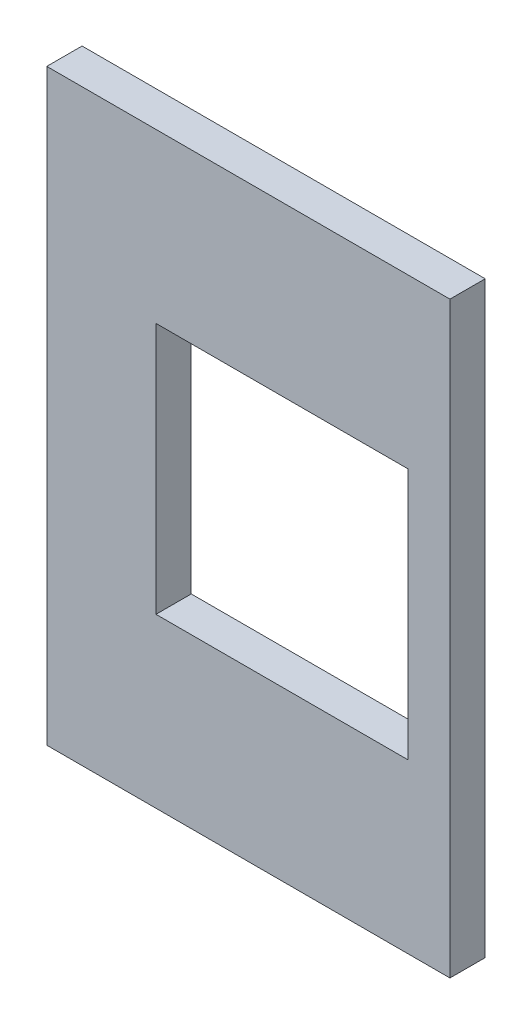
ISO-10303-21;
HEADER;
FILE_DESCRIPTION(('STEP AP214'),'2;1');
FILE_NAME('part.step','',(''),(''),'','','');
FILE_SCHEMA(('AUTOMOTIVE_DESIGN { 1 0 10303 214 1 1 1 1 }'));
ENDSEC;
DATA;
#1=APPLICATION_CONTEXT('core data for automotive mechanical design processes');
#2=APPLICATION_PROTOCOL_DEFINITION('international standard','automotive_design',2000,#1);
#3=PRODUCT_CONTEXT('',#1,'mechanical');
#4=PRODUCT('Part','Part','',(#3));
#5=PRODUCT_RELATED_PRODUCT_CATEGORY('part','',(#4));
#6=PRODUCT_DEFINITION_FORMATION('','',#4);
#7=PRODUCT_DEFINITION_CONTEXT('part definition',#1,'design');
#8=PRODUCT_DEFINITION('design','',#6,#7);
#9=PRODUCT_DEFINITION_SHAPE('','',#8);
#10=(LENGTH_UNIT() NAMED_UNIT(*) SI_UNIT(.MILLI.,.METRE.));
#11=(NAMED_UNIT(*) PLANE_ANGLE_UNIT() SI_UNIT($,.RADIAN.));
#12=(NAMED_UNIT(*) SI_UNIT($,.STERADIAN.) SOLID_ANGLE_UNIT());
#13=UNCERTAINTY_MEASURE_WITH_UNIT(LENGTH_MEASURE(1.E-05),#10,'distance_accuracy_value','');
#14=(GEOMETRIC_REPRESENTATION_CONTEXT(3) GLOBAL_UNCERTAINTY_ASSIGNED_CONTEXT((#13)) GLOBAL_UNIT_ASSIGNED_CONTEXT((#10,
#11,#12)) REPRESENTATION_CONTEXT('',''));
#15=CARTESIAN_POINT('',(0.,0.,0.));
#16=DIRECTION('',(0.,0.,1.));
#17=DIRECTION('',(1.,0.,0.));
#18=AXIS2_PLACEMENT_3D('',#15,#16,#17);
#19=CARTESIAN_POINT('',(0.,0.,2.667));
#20=DIRECTION('',(0.,0.,-1.));
#21=DIRECTION('',(-1.,0.,0.));
#22=AXIS2_PLACEMENT_3D('',#19,#20,#21);
#23=PLANE('',#22);
#24=DIRECTION('',(0.,1.,0.));
#25=VECTOR('',#24,1.);
#26=CARTESIAN_POINT('',(12.7,0.,2.667));
#27=LINE('',#26,#25);
#28=CARTESIAN_POINT('',(12.7,-22.225,2.667));
#29=VERTEX_POINT('',#28);
#30=CARTESIAN_POINT('',(12.7,22.225,2.667));
#31=VERTEX_POINT('',#30);
#32=EDGE_CURVE('E167',#29,#31,#27,.T.);
#33=ORIENTED_EDGE('',*,*,#32,.T.);
#34=DIRECTION('',(-1.,0.,0.));
#35=VECTOR('',#34,1.);
#36=CARTESIAN_POINT('',(0.,22.225,2.667));
#37=LINE('',#36,#35);
#38=CARTESIAN_POINT('',(-17.78,22.225,2.667));
#39=VERTEX_POINT('',#38);
#40=EDGE_CURVE('E175',#31,#39,#37,.T.);
#41=ORIENTED_EDGE('',*,*,#40,.T.);
#42=DIRECTION('',(0.,1.,0.));
#43=VECTOR('',#42,1.);
#44=CARTESIAN_POINT('',(-17.78,0.,2.667));
#45=LINE('',#44,#43);
#46=CARTESIAN_POINT('',(-17.78,-22.225,2.667));
#47=VERTEX_POINT('',#46);
#48=EDGE_CURVE('E127',#47,#39,#45,.T.);
#49=ORIENTED_EDGE('',*,*,#48,.F.);
#50=DIRECTION('',(1.,0.,0.));
#51=VECTOR('',#50,1.);
#52=CARTESIAN_POINT('',(0.,-22.225,2.667));
#53=LINE('',#52,#51);
#54=EDGE_CURVE('E170',#47,#29,#53,.T.);
#55=ORIENTED_EDGE('',*,*,#54,.T.);
#56=EDGE_LOOP('',(#33,#41,#49,#55));
#57=FACE_BOUND('',#56,.T.);
#58=DIRECTION('',(0.,-1.,0.));
#59=VECTOR('',#58,1.);
#60=CARTESIAN_POINT('',(-9.525,0.,2.667));
#61=LINE('',#60,#59);
#62=CARTESIAN_POINT('',(-9.525,9.525,2.667));
#63=VERTEX_POINT('',#62);
#64=CARTESIAN_POINT('',(-9.525,-9.525,2.667));
#65=VERTEX_POINT('',#64);
#66=EDGE_CURVE('E149',#63,#65,#61,.T.);
#67=ORIENTED_EDGE('',*,*,#66,.F.);
#68=DIRECTION('',(-1.,0.,0.));
#69=VECTOR('',#68,1.);
#70=CARTESIAN_POINT('',(0.,9.525,2.667));
#71=LINE('',#70,#69);
#72=CARTESIAN_POINT('',(9.525,9.525,2.667));
#73=VERTEX_POINT('',#72);
#74=EDGE_CURVE('E42',#73,#63,#71,.T.);
#75=ORIENTED_EDGE('',*,*,#74,.F.);
#76=DIRECTION('',(0.,1.,0.));
#77=VECTOR('',#76,1.);
#78=CARTESIAN_POINT('',(9.525,0.,2.667));
#79=LINE('',#78,#77);
#80=CARTESIAN_POINT('',(9.525,-9.525,2.667));
#81=VERTEX_POINT('',#80);
#82=EDGE_CURVE('E186',#81,#73,#79,.T.);
#83=ORIENTED_EDGE('',*,*,#82,.F.);
#84=DIRECTION('',(1.,0.,0.));
#85=VECTOR('',#84,1.);
#86=CARTESIAN_POINT('',(0.,-9.525,2.667));
#87=LINE('',#86,#85);
#88=EDGE_CURVE('E184',#65,#81,#87,.T.);
#89=ORIENTED_EDGE('',*,*,#88,.F.);
#90=EDGE_LOOP('',(#67,#75,#83,#89));
#91=FACE_BOUND('',#90,.T.);
#92=ADVANCED_FACE('F39',(#57,#91),#23,.F.);
#93=CARTESIAN_POINT('',(0.,0.,0.));
#94=DIRECTION('',(0.,0.,-1.));
#95=DIRECTION('',(-1.,0.,0.));
#96=AXIS2_PLACEMENT_3D('',#93,#94,#95);
#97=PLANE('',#96);
#98=DIRECTION('',(0.,1.,0.));
#99=VECTOR('',#98,1.);
#100=CARTESIAN_POINT('',(12.7,-22.225,0.));
#101=LINE('',#100,#99);
#102=CARTESIAN_POINT('',(12.7,-22.225,0.));
#103=VERTEX_POINT('',#102);
#104=CARTESIAN_POINT('',(12.7,22.225,0.));
#105=VERTEX_POINT('',#104);
#106=EDGE_CURVE('E112',#103,#105,#101,.T.);
#107=ORIENTED_EDGE('',*,*,#106,.F.);
#108=DIRECTION('',(1.,0.,0.));
#109=VECTOR('',#108,1.);
#110=CARTESIAN_POINT('',(-12.7,-22.225,0.));
#111=LINE('',#110,#109);
#112=CARTESIAN_POINT('',(-17.78,-22.225,0.));
#113=VERTEX_POINT('',#112);
#114=EDGE_CURVE('E111',#113,#103,#111,.T.);
#115=ORIENTED_EDGE('',*,*,#114,.F.);
#116=DIRECTION('',(0.,-1.,0.));
#117=VECTOR('',#116,1.);
#118=CARTESIAN_POINT('',(-17.78,22.225,0.));
#119=LINE('',#118,#117);
#120=CARTESIAN_POINT('',(-17.78,22.225,0.));
#121=VERTEX_POINT('',#120);
#122=EDGE_CURVE('E115',#121,#113,#119,.T.);
#123=ORIENTED_EDGE('',*,*,#122,.F.);
#124=DIRECTION('',(-1.,0.,0.));
#125=VECTOR('',#124,1.);
#126=CARTESIAN_POINT('',(-12.7,22.225,0.));
#127=LINE('',#126,#125);
#128=EDGE_CURVE('E101',#105,#121,#127,.T.);
#129=ORIENTED_EDGE('',*,*,#128,.F.);
#130=EDGE_LOOP('',(#107,#115,#123,#129));
#131=FACE_BOUND('',#130,.T.);
#132=DIRECTION('',(-1.,0.,0.));
#133=VECTOR('',#132,1.);
#134=CARTESIAN_POINT('',(-9.525,9.525,0.));
#135=LINE('',#134,#133);
#136=CARTESIAN_POINT('',(9.525,9.525,0.));
#137=VERTEX_POINT('',#136);
#138=CARTESIAN_POINT('',(-9.525,9.525,0.));
#139=VERTEX_POINT('',#138);
#140=EDGE_CURVE('E145',#137,#139,#135,.T.);
#141=ORIENTED_EDGE('',*,*,#140,.T.);
#142=DIRECTION('',(0.,-1.,0.));
#143=VECTOR('',#142,1.);
#144=CARTESIAN_POINT('',(-9.525,9.525,0.));
#145=LINE('',#144,#143);
#146=CARTESIAN_POINT('',(-9.525,-9.525,0.));
#147=VERTEX_POINT('',#146);
#148=EDGE_CURVE('E133',#139,#147,#145,.T.);
#149=ORIENTED_EDGE('',*,*,#148,.T.);
#150=DIRECTION('',(1.,0.,0.));
#151=VECTOR('',#150,1.);
#152=CARTESIAN_POINT('',(-9.525,-9.525,0.));
#153=LINE('',#152,#151);
#154=CARTESIAN_POINT('',(9.525,-9.525,0.));
#155=VERTEX_POINT('',#154);
#156=EDGE_CURVE('E137',#147,#155,#153,.T.);
#157=ORIENTED_EDGE('',*,*,#156,.T.);
#158=DIRECTION('',(0.,1.,0.));
#159=VECTOR('',#158,1.);
#160=CARTESIAN_POINT('',(9.525,9.525,0.));
#161=LINE('',#160,#159);
#162=EDGE_CURVE('E141',#155,#137,#161,.T.);
#163=ORIENTED_EDGE('',*,*,#162,.T.);
#164=EDGE_LOOP('',(#141,#149,#157,#163));
#165=FACE_BOUND('',#164,.T.);
#166=ADVANCED_FACE('F116',(#131,#165),#97,.T.);
#167=CARTESIAN_POINT('',(12.7,-22.225,3.175));
#168=DIRECTION('',(-1.,0.,0.));
#169=DIRECTION('',(0.,-1.,0.));
#170=AXIS2_PLACEMENT_3D('',#167,#168,#169);
#171=PLANE('',#170);
#172=ORIENTED_EDGE('',*,*,#106,.T.);
#173=DIRECTION('',(0.,0.,-1.));
#174=VECTOR('',#173,1.);
#175=CARTESIAN_POINT('',(12.7,22.225,3.175));
#176=LINE('',#175,#174);
#177=EDGE_CURVE('E12',#31,#105,#176,.T.);
#178=ORIENTED_EDGE('',*,*,#177,.F.);
#179=ORIENTED_EDGE('',*,*,#32,.F.);
#180=DIRECTION('',(0.,0.,-1.));
#181=VECTOR('',#180,1.);
#182=CARTESIAN_POINT('',(12.7,-22.225,3.175));
#183=LINE('',#182,#181);
#184=EDGE_CURVE('E49',#29,#103,#183,.T.);
#185=ORIENTED_EDGE('',*,*,#184,.T.);
#186=EDGE_LOOP('',(#172,#178,#179,#185));
#187=FACE_BOUND('',#186,.T.);
#188=ADVANCED_FACE('F206',(#187),#171,.F.);
#189=CARTESIAN_POINT('',(-12.7,22.225,3.175));
#190=DIRECTION('',(0.,-1.,0.));
#191=DIRECTION('',(1.,0.,0.));
#192=AXIS2_PLACEMENT_3D('',#189,#190,#191);
#193=PLANE('',#192);
#194=ORIENTED_EDGE('',*,*,#128,.T.);
#195=DIRECTION('',(0.,0.,-1.));
#196=VECTOR('',#195,1.);
#197=CARTESIAN_POINT('',(-17.78,22.225,3.175));
#198=LINE('',#197,#196);
#199=EDGE_CURVE('E105',#39,#121,#198,.T.);
#200=ORIENTED_EDGE('',*,*,#199,.F.);
#201=ORIENTED_EDGE('',*,*,#40,.F.);
#202=ORIENTED_EDGE('',*,*,#177,.T.);
#203=EDGE_LOOP('',(#194,#200,#201,#202));
#204=FACE_BOUND('',#203,.T.);
#205=ADVANCED_FACE('F103',(#204),#193,.F.);
#206=CARTESIAN_POINT('',(-12.7,-22.225,3.175));
#207=DIRECTION('',(0.,1.,0.));
#208=DIRECTION('',(-1.,0.,0.));
#209=AXIS2_PLACEMENT_3D('',#206,#207,#208);
#210=PLANE('',#209);
#211=ORIENTED_EDGE('',*,*,#114,.T.);
#212=ORIENTED_EDGE('',*,*,#184,.F.);
#213=ORIENTED_EDGE('',*,*,#54,.F.);
#214=DIRECTION('',(0.,0.,1.));
#215=VECTOR('',#214,1.);
#216=CARTESIAN_POINT('',(-17.78,-22.225,0.));
#217=LINE('',#216,#215);
#218=EDGE_CURVE('E122',#113,#47,#217,.T.);
#219=ORIENTED_EDGE('',*,*,#218,.F.);
#220=EDGE_LOOP('',(#211,#212,#213,#219));
#221=FACE_BOUND('',#220,.T.);
#222=ADVANCED_FACE('F217',(#221),#210,.F.);
#223=CARTESIAN_POINT('',(-9.525,9.525,3.175));
#224=DIRECTION('',(1.,0.,0.));
#225=DIRECTION('',(0.,1.,0.));
#226=AXIS2_PLACEMENT_3D('',#223,#224,#225);
#227=PLANE('',#226);
#228=ORIENTED_EDGE('',*,*,#148,.F.);
#229=DIRECTION('',(0.,0.,-1.));
#230=VECTOR('',#229,1.);
#231=CARTESIAN_POINT('',(-9.525,9.525,3.175));
#232=LINE('',#231,#230);
#233=EDGE_CURVE('E150',#63,#139,#232,.T.);
#234=ORIENTED_EDGE('',*,*,#233,.F.);
#235=ORIENTED_EDGE('',*,*,#66,.T.);
#236=DIRECTION('',(0.,0.,-1.));
#237=VECTOR('',#236,1.);
#238=CARTESIAN_POINT('',(-9.525,-9.525,3.175));
#239=LINE('',#238,#237);
#240=EDGE_CURVE('E159',#65,#147,#239,.T.);
#241=ORIENTED_EDGE('',*,*,#240,.T.);
#242=EDGE_LOOP('',(#228,#234,#235,#241));
#243=FACE_BOUND('',#242,.T.);
#244=ADVANCED_FACE('F198',(#243),#227,.T.);
#245=CARTESIAN_POINT('',(-9.525,-9.525,3.175));
#246=DIRECTION('',(0.,1.,0.));
#247=DIRECTION('',(-1.,0.,0.));
#248=AXIS2_PLACEMENT_3D('',#245,#246,#247);
#249=PLANE('',#248);
#250=ORIENTED_EDGE('',*,*,#156,.F.);
#251=ORIENTED_EDGE('',*,*,#240,.F.);
#252=ORIENTED_EDGE('',*,*,#88,.T.);
#253=DIRECTION('',(0.,0.,-1.));
#254=VECTOR('',#253,1.);
#255=CARTESIAN_POINT('',(9.525,-9.525,3.175));
#256=LINE('',#255,#254);
#257=EDGE_CURVE('E156',#81,#155,#256,.T.);
#258=ORIENTED_EDGE('',*,*,#257,.T.);
#259=EDGE_LOOP('',(#250,#251,#252,#258));
#260=FACE_BOUND('',#259,.T.);
#261=ADVANCED_FACE('F202',(#260),#249,.T.);
#262=CARTESIAN_POINT('',(9.525,9.525,3.175));
#263=DIRECTION('',(-1.,0.,0.));
#264=DIRECTION('',(0.,-1.,0.));
#265=AXIS2_PLACEMENT_3D('',#262,#263,#264);
#266=PLANE('',#265);
#267=ORIENTED_EDGE('',*,*,#162,.F.);
#268=ORIENTED_EDGE('',*,*,#257,.F.);
#269=ORIENTED_EDGE('',*,*,#82,.T.);
#270=DIRECTION('',(0.,0.,-1.));
#271=VECTOR('',#270,1.);
#272=CARTESIAN_POINT('',(9.525,9.525,3.175));
#273=LINE('',#272,#271);
#274=EDGE_CURVE('E57',#73,#137,#273,.T.);
#275=ORIENTED_EDGE('',*,*,#274,.T.);
#276=EDGE_LOOP('',(#267,#268,#269,#275));
#277=FACE_BOUND('',#276,.T.);
#278=ADVANCED_FACE('F204',(#277),#266,.T.);
#279=CARTESIAN_POINT('',(-9.525,9.525,3.175));
#280=DIRECTION('',(0.,-1.,0.));
#281=DIRECTION('',(1.,0.,0.));
#282=AXIS2_PLACEMENT_3D('',#279,#280,#281);
#283=PLANE('',#282);
#284=ORIENTED_EDGE('',*,*,#140,.F.);
#285=ORIENTED_EDGE('',*,*,#274,.F.);
#286=ORIENTED_EDGE('',*,*,#74,.T.);
#287=ORIENTED_EDGE('',*,*,#233,.T.);
#288=EDGE_LOOP('',(#284,#285,#286,#287));
#289=FACE_BOUND('',#288,.T.);
#290=ADVANCED_FACE('F194',(#289),#283,.T.);
#291=CARTESIAN_POINT('',(-17.78,0.,0.));
#292=DIRECTION('',(-1.,0.,0.));
#293=DIRECTION('',(0.,0.,1.));
#294=AXIS2_PLACEMENT_3D('',#291,#292,#293);
#295=PLANE('',#294);
#296=ORIENTED_EDGE('',*,*,#199,.T.);
#297=ORIENTED_EDGE('',*,*,#122,.T.);
#298=ORIENTED_EDGE('',*,*,#218,.T.);
#299=ORIENTED_EDGE('',*,*,#48,.T.);
#300=EDGE_LOOP('',(#296,#297,#298,#299));
#301=FACE_BOUND('',#300,.T.);
#302=ADVANCED_FACE('F125',(#301),#295,.T.);
#303=CLOSED_SHELL('',(#92,#166,#188,#205,#222,#244,#261,#278,#290,#302));
#304=MANIFOLD_SOLID_BREP('B2',#303);
#305=ADVANCED_BREP_SHAPE_REPRESENTATION('',(#18,#304),#14);
#306=SHAPE_DEFINITION_REPRESENTATION(#9,#305);
ENDSEC;
END-ISO-10303-21;
